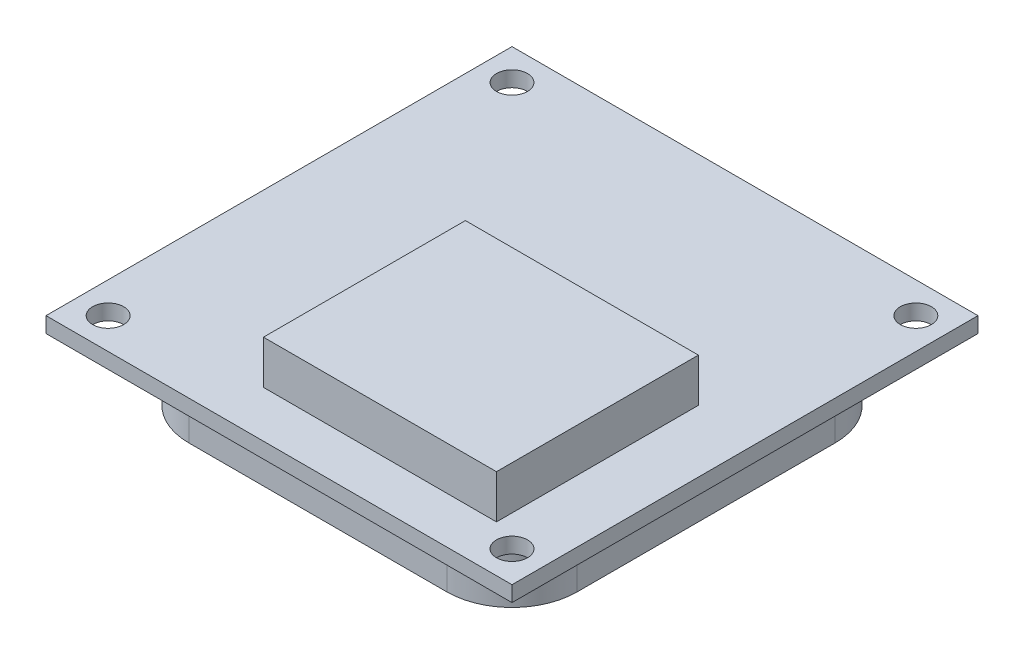
ISO-10303-21;
HEADER;
FILE_DESCRIPTION(('STEP AP214'),'2;1');
FILE_NAME('part.step','',(''),(''),'','','');
FILE_SCHEMA(('AUTOMOTIVE_DESIGN { 1 0 10303 214 1 1 1 1 }'));
ENDSEC;
DATA;
#1=APPLICATION_CONTEXT('core data for automotive mechanical design processes');
#2=APPLICATION_PROTOCOL_DEFINITION('international standard','automotive_design',2000,#1);
#3=PRODUCT_CONTEXT('',#1,'mechanical');
#4=PRODUCT('Part','Part','',(#3));
#5=PRODUCT_RELATED_PRODUCT_CATEGORY('part','',(#4));
#6=PRODUCT_DEFINITION_FORMATION('','',#4);
#7=PRODUCT_DEFINITION_CONTEXT('part definition',#1,'design');
#8=PRODUCT_DEFINITION('design','',#6,#7);
#9=PRODUCT_DEFINITION_SHAPE('','',#8);
#10=(LENGTH_UNIT() NAMED_UNIT(*) SI_UNIT(.MILLI.,.METRE.));
#11=(NAMED_UNIT(*) PLANE_ANGLE_UNIT() SI_UNIT($,.RADIAN.));
#12=(NAMED_UNIT(*) SI_UNIT($,.STERADIAN.) SOLID_ANGLE_UNIT());
#13=UNCERTAINTY_MEASURE_WITH_UNIT(LENGTH_MEASURE(1.E-05),#10,'distance_accuracy_value','');
#14=(GEOMETRIC_REPRESENTATION_CONTEXT(3) GLOBAL_UNCERTAINTY_ASSIGNED_CONTEXT((#13)) GLOBAL_UNIT_ASSIGNED_CONTEXT((#10,
#11,#12)) REPRESENTATION_CONTEXT('',''));
#15=CARTESIAN_POINT('',(0.,0.,0.));
#16=DIRECTION('',(0.,0.,1.));
#17=DIRECTION('',(1.,0.,0.));
#18=AXIS2_PLACEMENT_3D('',#15,#16,#17);
#19=CARTESIAN_POINT('',(0.,0.,0.));
#20=DIRECTION('',(0.,1.,0.));
#21=DIRECTION('',(0.,0.,1.));
#22=AXIS2_PLACEMENT_3D('',#19,#20,#21);
#23=PLANE('',#22);
#24=CARTESIAN_POINT('',(-10.6176470588235,0.,18.4264705882353));
#25=DIRECTION('',(0.,1.,0.));
#26=DIRECTION('',(0.,0.,1.));
#27=AXIS2_PLACEMENT_3D('',#24,#25,#26);
#28=CIRCLE('',#27,1.);
#29=CARTESIAN_POINT('',(-10.6176470588235,0.,19.4264705882353));
#30=VERTEX_POINT('',#29);
#31=EDGE_CURVE('E201',#30,#30,#28,.T.);
#32=ORIENTED_EDGE('',*,*,#31,.T.);
#33=EDGE_LOOP('',(#32));
#34=FACE_BOUND('',#33,.T.);
#35=CARTESIAN_POINT('',(15.3823529411765,0.,18.4264705882353));
#36=DIRECTION('',(0.,1.,0.));
#37=DIRECTION('',(0.,0.,1.));
#38=AXIS2_PLACEMENT_3D('',#35,#36,#37);
#39=CIRCLE('',#38,1.);
#40=CARTESIAN_POINT('',(15.3823529411765,0.,19.4264705882353));
#41=VERTEX_POINT('',#40);
#42=EDGE_CURVE('E205',#41,#41,#39,.T.);
#43=ORIENTED_EDGE('',*,*,#42,.T.);
#44=EDGE_LOOP('',(#43));
#45=FACE_BOUND('',#44,.T.);
#46=CARTESIAN_POINT('',(15.3823529411765,0.,-7.57352941176471));
#47=DIRECTION('',(0.,1.,0.));
#48=DIRECTION('',(0.,0.,1.));
#49=AXIS2_PLACEMENT_3D('',#46,#47,#48);
#50=CIRCLE('',#49,1.);
#51=CARTESIAN_POINT('',(15.3823529411765,0.,-6.5735294117647));
#52=VERTEX_POINT('',#51);
#53=EDGE_CURVE('E211',#52,#52,#50,.T.);
#54=ORIENTED_EDGE('',*,*,#53,.T.);
#55=EDGE_LOOP('',(#54));
#56=FACE_BOUND('',#55,.T.);
#57=CARTESIAN_POINT('',(-10.6176470588235,0.,-7.57352941176471));
#58=DIRECTION('',(0.,1.,0.));
#59=DIRECTION('',(0.,0.,1.));
#60=AXIS2_PLACEMENT_3D('',#57,#58,#59);
#61=CIRCLE('',#60,1.);
#62=CARTESIAN_POINT('',(-10.6176470588235,0.,-6.5735294117647));
#63=VERTEX_POINT('',#62);
#64=EDGE_CURVE('E217',#63,#63,#61,.T.);
#65=ORIENTED_EDGE('',*,*,#64,.T.);
#66=EDGE_LOOP('',(#65));
#67=FACE_BOUND('',#66,.T.);
#68=DIRECTION('',(0.,0.,1.));
#69=VECTOR('',#68,1.);
#70=CARTESIAN_POINT('',(-12.6176470588235,0.,-9.57352941176471));
#71=LINE('',#70,#69);
#72=CARTESIAN_POINT('',(-12.6176470588235,0.,-9.57352941176471));
#73=VERTEX_POINT('',#72);
#74=CARTESIAN_POINT('',(-12.6176470588235,0.,20.4264705882353));
#75=VERTEX_POINT('',#74);
#76=EDGE_CURVE('E223',#73,#75,#71,.T.);
#77=ORIENTED_EDGE('',*,*,#76,.F.);
#78=DIRECTION('',(-1.,0.,0.));
#79=VECTOR('',#78,1.);
#80=CARTESIAN_POINT('',(-12.6176470588235,0.,-9.57352941176471));
#81=LINE('',#80,#79);
#82=CARTESIAN_POINT('',(17.3823529411765,0.,-9.57352941176471));
#83=VERTEX_POINT('',#82);
#84=EDGE_CURVE('E230',#83,#73,#81,.T.);
#85=ORIENTED_EDGE('',*,*,#84,.F.);
#86=DIRECTION('',(0.,0.,-1.));
#87=VECTOR('',#86,1.);
#88=CARTESIAN_POINT('',(17.3823529411765,0.,-9.57352941176471));
#89=LINE('',#88,#87);
#90=CARTESIAN_POINT('',(17.3823529411765,0.,20.4264705882353));
#91=VERTEX_POINT('',#90);
#92=EDGE_CURVE('E241',#91,#83,#89,.T.);
#93=ORIENTED_EDGE('',*,*,#92,.F.);
#94=DIRECTION('',(1.,0.,0.));
#95=VECTOR('',#94,1.);
#96=CARTESIAN_POINT('',(-12.6176470588235,0.,20.4264705882353));
#97=LINE('',#96,#95);
#98=EDGE_CURVE('E239',#75,#91,#97,.T.);
#99=ORIENTED_EDGE('',*,*,#98,.F.);
#100=EDGE_LOOP('',(#77,#85,#93,#99));
#101=FACE_BOUND('',#100,.T.);
#102=CARTESIAN_POINT('',(10.6908576201184,0.,13.7349752671772));
#103=DIRECTION('',(0.,-1.,0.));
#104=DIRECTION('',(0.,0.,1.));
#105=AXIS2_PLACEMENT_3D('',#102,#103,#104);
#106=CIRCLE('',#105,4.19149532105807);
#107=CARTESIAN_POINT('',(14.8823529411765,0.,13.7349752671772));
#108=VERTEX_POINT('',#107);
#109=CARTESIAN_POINT('',(10.6908576201184,0.,17.9264705882353));
#110=VERTEX_POINT('',#109);
#111=EDGE_CURVE('E166',#108,#110,#106,.T.);
#112=ORIENTED_EDGE('',*,*,#111,.F.);
#113=DIRECTION('',(0.,0.,1.));
#114=VECTOR('',#113,1.);
#115=CARTESIAN_POINT('',(14.8823529411765,0.,13.7349752671772));
#116=LINE('',#115,#114);
#117=CARTESIAN_POINT('',(14.8823529411765,0.,-2.88203409070664));
#118=VERTEX_POINT('',#117);
#119=EDGE_CURVE('E163',#118,#108,#116,.T.);
#120=ORIENTED_EDGE('',*,*,#119,.F.);
#121=CARTESIAN_POINT('',(10.6908576201184,0.,-2.88203409070664));
#122=DIRECTION('',(0.,-1.,0.));
#123=DIRECTION('',(0.,0.,1.));
#124=AXIS2_PLACEMENT_3D('',#121,#122,#123);
#125=CIRCLE('',#124,4.19149532105807);
#126=CARTESIAN_POINT('',(10.6908576201184,0.,-7.07352941176471));
#127=VERTEX_POINT('',#126);
#128=EDGE_CURVE('E500',#127,#118,#125,.T.);
#129=ORIENTED_EDGE('',*,*,#128,.F.);
#130=DIRECTION('',(1.,0.,0.));
#131=VECTOR('',#130,1.);
#132=CARTESIAN_POINT('',(-5.92615173776546,0.,-7.07352941176471));
#133=LINE('',#132,#131);
#134=CARTESIAN_POINT('',(-5.92615173776546,0.,-7.07352941176471));
#135=VERTEX_POINT('',#134);
#136=EDGE_CURVE('E531',#135,#127,#133,.T.);
#137=ORIENTED_EDGE('',*,*,#136,.F.);
#138=CARTESIAN_POINT('',(-5.92615173776546,0.,-2.88203409070664));
#139=DIRECTION('',(0.,-1.,0.));
#140=DIRECTION('',(0.,0.,1.));
#141=AXIS2_PLACEMENT_3D('',#138,#139,#140);
#142=CIRCLE('',#141,4.19149532105807);
#143=CARTESIAN_POINT('',(-10.1176470588235,0.,-2.88203409070664));
#144=VERTEX_POINT('',#143);
#145=EDGE_CURVE('E524',#144,#135,#142,.T.);
#146=ORIENTED_EDGE('',*,*,#145,.F.);
#147=DIRECTION('',(0.,0.,-1.));
#148=VECTOR('',#147,1.);
#149=CARTESIAN_POINT('',(-10.1176470588235,0.,13.7349752671772));
#150=LINE('',#149,#148);
#151=CARTESIAN_POINT('',(-10.1176470588235,0.,13.7349752671772));
#152=VERTEX_POINT('',#151);
#153=EDGE_CURVE('E521',#152,#144,#150,.T.);
#154=ORIENTED_EDGE('',*,*,#153,.F.);
#155=CARTESIAN_POINT('',(-5.92615173776546,0.,13.7349752671772));
#156=DIRECTION('',(0.,-1.,0.));
#157=DIRECTION('',(0.,0.,1.));
#158=AXIS2_PLACEMENT_3D('',#155,#156,#157);
#159=CIRCLE('',#158,4.19149532105807);
#160=CARTESIAN_POINT('',(-5.92615173776546,0.,17.9264705882353));
#161=VERTEX_POINT('',#160);
#162=EDGE_CURVE('E53',#161,#152,#159,.T.);
#163=ORIENTED_EDGE('',*,*,#162,.F.);
#164=DIRECTION('',(-1.,0.,0.));
#165=VECTOR('',#164,1.);
#166=CARTESIAN_POINT('',(-5.92615173776546,0.,17.9264705882353));
#167=LINE('',#166,#165);
#168=EDGE_CURVE('E48',#110,#161,#167,.T.);
#169=ORIENTED_EDGE('',*,*,#168,.F.);
#170=EDGE_LOOP('',(#112,#120,#129,#137,#146,#154,#163,#169));
#171=FACE_BOUND('',#170,.T.);
#172=ADVANCED_FACE('F33',(#34,#45,#56,#67,#101,#171),#23,.F.);
#173=CARTESIAN_POINT('',(0.,1.,0.));
#174=DIRECTION('',(0.,1.,0.));
#175=DIRECTION('',(0.,0.,1.));
#176=AXIS2_PLACEMENT_3D('',#173,#174,#175);
#177=PLANE('',#176);
#178=CARTESIAN_POINT('',(15.3823529411765,1.,18.4264705882353));
#179=DIRECTION('',(0.,1.,0.));
#180=DIRECTION('',(0.,0.,1.));
#181=AXIS2_PLACEMENT_3D('',#178,#179,#180);
#182=CIRCLE('',#181,1.);
#183=CARTESIAN_POINT('',(15.3823529411765,1.,19.4264705882353));
#184=VERTEX_POINT('',#183);
#185=EDGE_CURVE('E208',#184,#184,#182,.T.);
#186=ORIENTED_EDGE('',*,*,#185,.F.);
#187=EDGE_LOOP('',(#186));
#188=FACE_BOUND('',#187,.T.);
#189=CARTESIAN_POINT('',(-10.6176470588235,1.,-7.57352941176471));
#190=DIRECTION('',(0.,1.,0.));
#191=DIRECTION('',(0.,0.,1.));
#192=AXIS2_PLACEMENT_3D('',#189,#190,#191);
#193=CIRCLE('',#192,1.);
#194=CARTESIAN_POINT('',(-10.6176470588235,1.,-6.5735294117647));
#195=VERTEX_POINT('',#194);
#196=EDGE_CURVE('E220',#195,#195,#193,.T.);
#197=ORIENTED_EDGE('',*,*,#196,.F.);
#198=EDGE_LOOP('',(#197));
#199=FACE_BOUND('',#198,.T.);
#200=DIRECTION('',(0.,0.,1.));
#201=VECTOR('',#200,1.);
#202=CARTESIAN_POINT('',(-12.6176470588235,1.,-9.57352941176471));
#203=LINE('',#202,#201);
#204=CARTESIAN_POINT('',(-12.6176470588235,1.,-9.57352941176471));
#205=VERTEX_POINT('',#204);
#206=CARTESIAN_POINT('',(-12.6176470588235,1.,20.4264705882353));
#207=VERTEX_POINT('',#206);
#208=EDGE_CURVE('E226',#205,#207,#203,.T.);
#209=ORIENTED_EDGE('',*,*,#208,.T.);
#210=DIRECTION('',(1.,0.,0.));
#211=VECTOR('',#210,1.);
#212=CARTESIAN_POINT('',(-12.6176470588235,1.,20.4264705882353));
#213=LINE('',#212,#211);
#214=CARTESIAN_POINT('',(17.3823529411765,1.,20.4264705882353));
#215=VERTEX_POINT('',#214);
#216=EDGE_CURVE('E229',#207,#215,#213,.T.);
#217=ORIENTED_EDGE('',*,*,#216,.T.);
#218=DIRECTION('',(0.,0.,-1.));
#219=VECTOR('',#218,1.);
#220=CARTESIAN_POINT('',(17.3823529411765,1.,-9.57352941176471));
#221=LINE('',#220,#219);
#222=CARTESIAN_POINT('',(17.3823529411765,1.,-9.57352941176471));
#223=VERTEX_POINT('',#222);
#224=EDGE_CURVE('E232',#215,#223,#221,.T.);
#225=ORIENTED_EDGE('',*,*,#224,.T.);
#226=DIRECTION('',(-1.,0.,0.));
#227=VECTOR('',#226,1.);
#228=CARTESIAN_POINT('',(-12.6176470588235,1.,-9.57352941176471));
#229=LINE('',#228,#227);
#230=EDGE_CURVE('E234',#223,#205,#229,.T.);
#231=ORIENTED_EDGE('',*,*,#230,.T.);
#232=EDGE_LOOP('',(#209,#217,#225,#231));
#233=FACE_BOUND('',#232,.T.);
#234=CARTESIAN_POINT('',(15.3823529411765,1.,-7.57352941176471));
#235=DIRECTION('',(0.,1.,0.));
#236=DIRECTION('',(0.,0.,1.));
#237=AXIS2_PLACEMENT_3D('',#234,#235,#236);
#238=CIRCLE('',#237,1.);
#239=CARTESIAN_POINT('',(15.3823529411765,1.,-6.5735294117647));
#240=VERTEX_POINT('',#239);
#241=EDGE_CURVE('E214',#240,#240,#238,.T.);
#242=ORIENTED_EDGE('',*,*,#241,.F.);
#243=EDGE_LOOP('',(#242));
#244=FACE_BOUND('',#243,.T.);
#245=CARTESIAN_POINT('',(-10.6176470588235,1.,18.4264705882353));
#246=DIRECTION('',(0.,1.,0.));
#247=DIRECTION('',(0.,0.,1.));
#248=AXIS2_PLACEMENT_3D('',#245,#246,#247);
#249=CIRCLE('',#248,1.);
#250=CARTESIAN_POINT('',(-10.6176470588235,1.,19.4264705882353));
#251=VERTEX_POINT('',#250);
#252=EDGE_CURVE('E202',#251,#251,#249,.T.);
#253=ORIENTED_EDGE('',*,*,#252,.F.);
#254=EDGE_LOOP('',(#253));
#255=FACE_BOUND('',#254,.T.);
#256=DIRECTION('',(1.,0.,0.));
#257=VECTOR('',#256,1.);
#258=CARTESIAN_POINT('',(-1.61764705882352,1.,17.4264705882353));
#259=LINE('',#258,#257);
#260=CARTESIAN_POINT('',(-1.61764705882352,1.,17.4264705882353));
#261=VERTEX_POINT('',#260);
#262=CARTESIAN_POINT('',(13.3823529411765,1.,17.4264705882353));
#263=VERTEX_POINT('',#262);
#264=EDGE_CURVE('E170',#261,#263,#259,.T.);
#265=ORIENTED_EDGE('',*,*,#264,.F.);
#266=DIRECTION('',(0.,0.,1.));
#267=VECTOR('',#266,1.);
#268=CARTESIAN_POINT('',(-1.61764705882353,1.,4.42647058823529));
#269=LINE('',#268,#267);
#270=CARTESIAN_POINT('',(-1.61764705882353,1.,4.42647058823529));
#271=VERTEX_POINT('',#270);
#272=EDGE_CURVE('E167',#271,#261,#269,.T.);
#273=ORIENTED_EDGE('',*,*,#272,.F.);
#274=DIRECTION('',(-1.,0.,0.));
#275=VECTOR('',#274,1.);
#276=CARTESIAN_POINT('',(-1.61764705882353,1.,4.42647058823529));
#277=LINE('',#276,#275);
#278=CARTESIAN_POINT('',(13.3823529411765,1.,4.42647058823529));
#279=VERTEX_POINT('',#278);
#280=EDGE_CURVE('E180',#279,#271,#277,.T.);
#281=ORIENTED_EDGE('',*,*,#280,.F.);
#282=DIRECTION('',(0.,0.,-1.));
#283=VECTOR('',#282,1.);
#284=CARTESIAN_POINT('',(13.3823529411765,1.,4.42647058823529));
#285=LINE('',#284,#283);
#286=EDGE_CURVE('E188',#263,#279,#285,.T.);
#287=ORIENTED_EDGE('',*,*,#286,.F.);
#288=EDGE_LOOP('',(#265,#273,#281,#287));
#289=FACE_BOUND('',#288,.T.);
#290=ADVANCED_FACE('F267',(#188,#199,#233,#244,#255,#289),#177,.T.);
#291=CARTESIAN_POINT('',(-12.6176470588235,1.,-9.57352941176471));
#292=DIRECTION('',(1.,0.,0.));
#293=DIRECTION('',(0.,0.,-1.));
#294=AXIS2_PLACEMENT_3D('',#291,#292,#293);
#295=PLANE('',#294);
#296=ORIENTED_EDGE('',*,*,#76,.T.);
#297=DIRECTION('',(0.,-1.,0.));
#298=VECTOR('',#297,1.);
#299=CARTESIAN_POINT('',(-12.6176470588235,1.,20.4264705882353));
#300=LINE('',#299,#298);
#301=EDGE_CURVE('E11',#207,#75,#300,.T.);
#302=ORIENTED_EDGE('',*,*,#301,.F.);
#303=ORIENTED_EDGE('',*,*,#208,.F.);
#304=DIRECTION('',(0.,-1.,0.));
#305=VECTOR('',#304,1.);
#306=CARTESIAN_POINT('',(-12.6176470588235,1.,-9.57352941176471));
#307=LINE('',#306,#305);
#308=EDGE_CURVE('E236',#205,#73,#307,.T.);
#309=ORIENTED_EDGE('',*,*,#308,.T.);
#310=EDGE_LOOP('',(#296,#302,#303,#309));
#311=FACE_BOUND('',#310,.T.);
#312=ADVANCED_FACE('F35',(#311),#295,.F.);
#313=CARTESIAN_POINT('',(-12.6176470588235,1.,20.4264705882353));
#314=DIRECTION('',(0.,0.,-1.));
#315=DIRECTION('',(-1.,0.,0.));
#316=AXIS2_PLACEMENT_3D('',#313,#314,#315);
#317=PLANE('',#316);
#318=ORIENTED_EDGE('',*,*,#98,.T.);
#319=DIRECTION('',(0.,-1.,0.));
#320=VECTOR('',#319,1.);
#321=CARTESIAN_POINT('',(17.3823529411765,1.,20.4264705882353));
#322=LINE('',#321,#320);
#323=EDGE_CURVE('E41',#215,#91,#322,.T.);
#324=ORIENTED_EDGE('',*,*,#323,.F.);
#325=ORIENTED_EDGE('',*,*,#216,.F.);
#326=ORIENTED_EDGE('',*,*,#301,.T.);
#327=EDGE_LOOP('',(#318,#324,#325,#326));
#328=FACE_BOUND('',#327,.T.);
#329=ADVANCED_FACE('F269',(#328),#317,.F.);
#330=CARTESIAN_POINT('',(17.3823529411765,1.,-9.57352941176471));
#331=DIRECTION('',(-1.,0.,0.));
#332=DIRECTION('',(0.,0.,1.));
#333=AXIS2_PLACEMENT_3D('',#330,#331,#332);
#334=PLANE('',#333);
#335=ORIENTED_EDGE('',*,*,#92,.T.);
#336=DIRECTION('',(0.,-1.,0.));
#337=VECTOR('',#336,1.);
#338=CARTESIAN_POINT('',(17.3823529411765,1.,-9.57352941176471));
#339=LINE('',#338,#337);
#340=EDGE_CURVE('E246',#223,#83,#339,.T.);
#341=ORIENTED_EDGE('',*,*,#340,.F.);
#342=ORIENTED_EDGE('',*,*,#224,.F.);
#343=ORIENTED_EDGE('',*,*,#323,.T.);
#344=EDGE_LOOP('',(#335,#341,#342,#343));
#345=FACE_BOUND('',#344,.T.);
#346=ADVANCED_FACE('F253',(#345),#334,.F.);
#347=CARTESIAN_POINT('',(-12.6176470588235,1.,-9.57352941176471));
#348=DIRECTION('',(0.,0.,1.));
#349=DIRECTION('',(1.,0.,0.));
#350=AXIS2_PLACEMENT_3D('',#347,#348,#349);
#351=PLANE('',#350);
#352=ORIENTED_EDGE('',*,*,#84,.T.);
#353=ORIENTED_EDGE('',*,*,#308,.F.);
#354=ORIENTED_EDGE('',*,*,#230,.F.);
#355=ORIENTED_EDGE('',*,*,#340,.T.);
#356=EDGE_LOOP('',(#352,#353,#354,#355));
#357=FACE_BOUND('',#356,.T.);
#358=ADVANCED_FACE('F261',(#357),#351,.F.);
#359=CARTESIAN_POINT('',(-10.6176470588235,1.,-7.57352941176471));
#360=DIRECTION('',(0.,-1.,0.));
#361=DIRECTION('',(0.,0.,-1.));
#362=AXIS2_PLACEMENT_3D('',#359,#360,#361);
#363=CYLINDRICAL_SURFACE('',#362,1.);
#364=ORIENTED_EDGE('',*,*,#196,.T.);
#365=EDGE_LOOP('',(#364));
#366=FACE_BOUND('',#365,.T.);
#367=ORIENTED_EDGE('',*,*,#64,.F.);
#368=EDGE_LOOP('',(#367));
#369=FACE_BOUND('',#368,.T.);
#370=ADVANCED_FACE('F288',(#366,#369),#363,.F.);
#371=CARTESIAN_POINT('',(15.3823529411765,1.,-7.57352941176471));
#372=DIRECTION('',(0.,-1.,0.));
#373=DIRECTION('',(0.,0.,-1.));
#374=AXIS2_PLACEMENT_3D('',#371,#372,#373);
#375=CYLINDRICAL_SURFACE('',#374,1.);
#376=ORIENTED_EDGE('',*,*,#241,.T.);
#377=EDGE_LOOP('',(#376));
#378=FACE_BOUND('',#377,.T.);
#379=ORIENTED_EDGE('',*,*,#53,.F.);
#380=EDGE_LOOP('',(#379));
#381=FACE_BOUND('',#380,.T.);
#382=ADVANCED_FACE('F292',(#378,#381),#375,.F.);
#383=CARTESIAN_POINT('',(15.3823529411765,1.,18.4264705882353));
#384=DIRECTION('',(0.,-1.,0.));
#385=DIRECTION('',(0.,0.,-1.));
#386=AXIS2_PLACEMENT_3D('',#383,#384,#385);
#387=CYLINDRICAL_SURFACE('',#386,1.);
#388=ORIENTED_EDGE('',*,*,#185,.T.);
#389=EDGE_LOOP('',(#388));
#390=FACE_BOUND('',#389,.T.);
#391=ORIENTED_EDGE('',*,*,#42,.F.);
#392=EDGE_LOOP('',(#391));
#393=FACE_BOUND('',#392,.T.);
#394=ADVANCED_FACE('F297',(#390,#393),#387,.F.);
#395=CARTESIAN_POINT('',(-10.6176470588235,1.,18.4264705882353));
#396=DIRECTION('',(0.,-1.,0.));
#397=DIRECTION('',(0.,0.,-1.));
#398=AXIS2_PLACEMENT_3D('',#395,#396,#397);
#399=CYLINDRICAL_SURFACE('',#398,1.);
#400=ORIENTED_EDGE('',*,*,#252,.T.);
#401=EDGE_LOOP('',(#400));
#402=FACE_BOUND('',#401,.T.);
#403=ORIENTED_EDGE('',*,*,#31,.F.);
#404=EDGE_LOOP('',(#403));
#405=FACE_BOUND('',#404,.T.);
#406=ADVANCED_FACE('F304',(#402,#405),#399,.F.);
#407=CARTESIAN_POINT('',(-1.61764705882353,3.8,4.42647058823529));
#408=DIRECTION('',(1.,0.,0.));
#409=DIRECTION('',(0.,0.,-1.));
#410=AXIS2_PLACEMENT_3D('',#407,#408,#409);
#411=PLANE('',#410);
#412=ORIENTED_EDGE('',*,*,#272,.T.);
#413=DIRECTION('',(0.,-1.,0.));
#414=VECTOR('',#413,1.);
#415=CARTESIAN_POINT('',(-1.61764705882352,3.8,17.4264705882353));
#416=LINE('',#415,#414);
#417=CARTESIAN_POINT('',(-1.61764705882352,3.8,17.4264705882353));
#418=VERTEX_POINT('',#417);
#419=EDGE_CURVE('E199',#418,#261,#416,.T.);
#420=ORIENTED_EDGE('',*,*,#419,.F.);
#421=DIRECTION('',(0.,0.,1.));
#422=VECTOR('',#421,1.);
#423=CARTESIAN_POINT('',(-1.61764705882353,3.8,4.42647058823529));
#424=LINE('',#423,#422);
#425=CARTESIAN_POINT('',(-1.61764705882353,3.8,4.42647058823529));
#426=VERTEX_POINT('',#425);
#427=EDGE_CURVE('E176',#426,#418,#424,.T.);
#428=ORIENTED_EDGE('',*,*,#427,.F.);
#429=DIRECTION('',(0.,-1.,0.));
#430=VECTOR('',#429,1.);
#431=CARTESIAN_POINT('',(-1.61764705882353,3.8,4.42647058823529));
#432=LINE('',#431,#430);
#433=EDGE_CURVE('E185',#426,#271,#432,.T.);
#434=ORIENTED_EDGE('',*,*,#433,.T.);
#435=EDGE_LOOP('',(#412,#420,#428,#434));
#436=FACE_BOUND('',#435,.T.);
#437=ADVANCED_FACE('F308',(#436),#411,.F.);
#438=CARTESIAN_POINT('',(-1.61764705882352,3.8,17.4264705882353));
#439=DIRECTION('',(0.,0.,-1.));
#440=DIRECTION('',(-1.,0.,0.));
#441=AXIS2_PLACEMENT_3D('',#438,#439,#440);
#442=PLANE('',#441);
#443=ORIENTED_EDGE('',*,*,#264,.T.);
#444=DIRECTION('',(0.,-1.,0.));
#445=VECTOR('',#444,1.);
#446=CARTESIAN_POINT('',(13.3823529411765,3.8,17.4264705882353));
#447=LINE('',#446,#445);
#448=CARTESIAN_POINT('',(13.3823529411765,3.8,17.4264705882353));
#449=VERTEX_POINT('',#448);
#450=EDGE_CURVE('E196',#449,#263,#447,.T.);
#451=ORIENTED_EDGE('',*,*,#450,.F.);
#452=DIRECTION('',(1.,0.,0.));
#453=VECTOR('',#452,1.);
#454=CARTESIAN_POINT('',(-1.61764705882352,3.8,17.4264705882353));
#455=LINE('',#454,#453);
#456=EDGE_CURVE('E179',#418,#449,#455,.T.);
#457=ORIENTED_EDGE('',*,*,#456,.F.);
#458=ORIENTED_EDGE('',*,*,#419,.T.);
#459=EDGE_LOOP('',(#443,#451,#457,#458));
#460=FACE_BOUND('',#459,.T.);
#461=ADVANCED_FACE('F312',(#460),#442,.F.);
#462=CARTESIAN_POINT('',(13.3823529411765,3.8,4.42647058823529));
#463=DIRECTION('',(-1.,0.,0.));
#464=DIRECTION('',(0.,0.,1.));
#465=AXIS2_PLACEMENT_3D('',#462,#463,#464);
#466=PLANE('',#465);
#467=ORIENTED_EDGE('',*,*,#286,.T.);
#468=DIRECTION('',(0.,-1.,0.));
#469=VECTOR('',#468,1.);
#470=CARTESIAN_POINT('',(13.3823529411765,3.8,4.42647058823529));
#471=LINE('',#470,#469);
#472=CARTESIAN_POINT('',(13.3823529411765,3.8,4.42647058823529));
#473=VERTEX_POINT('',#472);
#474=EDGE_CURVE('E194',#473,#279,#471,.T.);
#475=ORIENTED_EDGE('',*,*,#474,.F.);
#476=DIRECTION('',(0.,0.,-1.));
#477=VECTOR('',#476,1.);
#478=CARTESIAN_POINT('',(13.3823529411765,3.8,4.42647058823529));
#479=LINE('',#478,#477);
#480=EDGE_CURVE('E182',#449,#473,#479,.T.);
#481=ORIENTED_EDGE('',*,*,#480,.F.);
#482=ORIENTED_EDGE('',*,*,#450,.T.);
#483=EDGE_LOOP('',(#467,#475,#481,#482));
#484=FACE_BOUND('',#483,.T.);
#485=ADVANCED_FACE('F316',(#484),#466,.F.);
#486=CARTESIAN_POINT('',(-1.61764705882353,3.8,4.42647058823529));
#487=DIRECTION('',(0.,0.,1.));
#488=DIRECTION('',(1.,0.,0.));
#489=AXIS2_PLACEMENT_3D('',#486,#487,#488);
#490=PLANE('',#489);
#491=ORIENTED_EDGE('',*,*,#280,.T.);
#492=ORIENTED_EDGE('',*,*,#433,.F.);
#493=DIRECTION('',(-1.,0.,0.));
#494=VECTOR('',#493,1.);
#495=CARTESIAN_POINT('',(-1.61764705882353,3.8,4.42647058823529));
#496=LINE('',#495,#494);
#497=EDGE_CURVE('E184',#473,#426,#496,.T.);
#498=ORIENTED_EDGE('',*,*,#497,.F.);
#499=ORIENTED_EDGE('',*,*,#474,.T.);
#500=EDGE_LOOP('',(#491,#492,#498,#499));
#501=FACE_BOUND('',#500,.T.);
#502=ADVANCED_FACE('F320',(#501),#490,.F.);
#503=CARTESIAN_POINT('',(0.,3.8,0.));
#504=DIRECTION('',(0.,1.,0.));
#505=DIRECTION('',(0.,0.,1.));
#506=AXIS2_PLACEMENT_3D('',#503,#504,#505);
#507=PLANE('',#506);
#508=ORIENTED_EDGE('',*,*,#427,.T.);
#509=ORIENTED_EDGE('',*,*,#456,.T.);
#510=ORIENTED_EDGE('',*,*,#480,.T.);
#511=ORIENTED_EDGE('',*,*,#497,.T.);
#512=EDGE_LOOP('',(#508,#509,#510,#511));
#513=FACE_BOUND('',#512,.T.);
#514=ADVANCED_FACE('F324',(#513),#507,.T.);
#515=CARTESIAN_POINT('',(10.6908576201184,-4.,13.7349752671772));
#516=DIRECTION('',(0.,1.,0.));
#517=DIRECTION('',(0.,0.,1.));
#518=AXIS2_PLACEMENT_3D('',#515,#516,#517);
#519=CYLINDRICAL_SURFACE('',#518,4.19149532105807);
#520=ORIENTED_EDGE('',*,*,#111,.T.);
#521=DIRECTION('',(0.,1.,0.));
#522=VECTOR('',#521,1.);
#523=CARTESIAN_POINT('',(10.6908576201184,-4.,17.9264705882353));
#524=LINE('',#523,#522);
#525=CARTESIAN_POINT('',(10.6908576201184,-4.,17.9264705882353));
#526=VERTEX_POINT('',#525);
#527=EDGE_CURVE('E147',#526,#110,#524,.T.);
#528=ORIENTED_EDGE('',*,*,#527,.F.);
#529=CARTESIAN_POINT('',(10.6908576201184,-4.,13.7349752671772));
#530=DIRECTION('',(0.,-1.,0.));
#531=DIRECTION('',(0.,0.,1.));
#532=AXIS2_PLACEMENT_3D('',#529,#530,#531);
#533=CIRCLE('',#532,4.19149532105807);
#534=CARTESIAN_POINT('',(14.8823529411765,-4.,13.7349752671772));
#535=VERTEX_POINT('',#534);
#536=EDGE_CURVE('E154',#535,#526,#533,.T.);
#537=ORIENTED_EDGE('',*,*,#536,.F.);
#538=DIRECTION('',(0.,1.,0.));
#539=VECTOR('',#538,1.);
#540=CARTESIAN_POINT('',(14.8823529411765,-4.,13.7349752671772));
#541=LINE('',#540,#539);
#542=EDGE_CURVE('E496',#535,#108,#541,.T.);
#543=ORIENTED_EDGE('',*,*,#542,.T.);
#544=EDGE_LOOP('',(#520,#528,#537,#543));
#545=FACE_BOUND('',#544,.T.);
#546=ADVANCED_FACE('F165',(#545),#519,.T.);
#547=CARTESIAN_POINT('',(-5.92615173776546,-4.,17.9264705882353));
#548=DIRECTION('',(0.,0.,-1.));
#549=DIRECTION('',(-1.,0.,0.));
#550=AXIS2_PLACEMENT_3D('',#547,#548,#549);
#551=PLANE('',#550);
#552=ORIENTED_EDGE('',*,*,#168,.T.);
#553=DIRECTION('',(0.,1.,0.));
#554=VECTOR('',#553,1.);
#555=CARTESIAN_POINT('',(-5.92615173776546,-4.,17.9264705882353));
#556=LINE('',#555,#554);
#557=CARTESIAN_POINT('',(-5.92615173776546,-4.,17.9264705882353));
#558=VERTEX_POINT('',#557);
#559=EDGE_CURVE('E150',#558,#161,#556,.T.);
#560=ORIENTED_EDGE('',*,*,#559,.F.);
#561=DIRECTION('',(-1.,0.,0.));
#562=VECTOR('',#561,1.);
#563=CARTESIAN_POINT('',(-5.92615173776546,-4.,17.9264705882353));
#564=LINE('',#563,#562);
#565=EDGE_CURVE('E143',#526,#558,#564,.T.);
#566=ORIENTED_EDGE('',*,*,#565,.F.);
#567=ORIENTED_EDGE('',*,*,#527,.T.);
#568=EDGE_LOOP('',(#552,#560,#566,#567));
#569=FACE_BOUND('',#568,.T.);
#570=ADVANCED_FACE('F145',(#569),#551,.F.);
#571=CARTESIAN_POINT('',(-5.92615173776546,-4.,13.7349752671772));
#572=DIRECTION('',(0.,1.,0.));
#573=DIRECTION('',(0.,0.,1.));
#574=AXIS2_PLACEMENT_3D('',#571,#572,#573);
#575=CYLINDRICAL_SURFACE('',#574,4.19149532105807);
#576=ORIENTED_EDGE('',*,*,#162,.T.);
#577=DIRECTION('',(0.,1.,0.));
#578=VECTOR('',#577,1.);
#579=CARTESIAN_POINT('',(-10.1176470588235,-4.,13.7349752671772));
#580=LINE('',#579,#578);
#581=CARTESIAN_POINT('',(-10.1176470588235,-4.,13.7349752671772));
#582=VERTEX_POINT('',#581);
#583=EDGE_CURVE('E172',#582,#152,#580,.T.);
#584=ORIENTED_EDGE('',*,*,#583,.F.);
#585=CARTESIAN_POINT('',(-5.92615173776546,-4.,13.7349752671772));
#586=DIRECTION('',(0.,-1.,0.));
#587=DIRECTION('',(0.,0.,1.));
#588=AXIS2_PLACEMENT_3D('',#585,#586,#587);
#589=CIRCLE('',#588,4.19149532105807);
#590=EDGE_CURVE('E153',#558,#582,#589,.T.);
#591=ORIENTED_EDGE('',*,*,#590,.F.);
#592=ORIENTED_EDGE('',*,*,#559,.T.);
#593=EDGE_LOOP('',(#576,#584,#591,#592));
#594=FACE_BOUND('',#593,.T.);
#595=ADVANCED_FACE('F333',(#594),#575,.T.);
#596=CARTESIAN_POINT('',(-10.1176470588235,-4.,13.7349752671772));
#597=DIRECTION('',(1.,0.,0.));
#598=DIRECTION('',(0.,0.,-1.));
#599=AXIS2_PLACEMENT_3D('',#596,#597,#598);
#600=PLANE('',#599);
#601=ORIENTED_EDGE('',*,*,#153,.T.);
#602=DIRECTION('',(0.,1.,0.));
#603=VECTOR('',#602,1.);
#604=CARTESIAN_POINT('',(-10.1176470588235,-4.,-2.88203409070664));
#605=LINE('',#604,#603);
#606=CARTESIAN_POINT('',(-10.1176470588235,-4.,-2.88203409070664));
#607=VERTEX_POINT('',#606);
#608=EDGE_CURVE('E514',#607,#144,#605,.T.);
#609=ORIENTED_EDGE('',*,*,#608,.F.);
#610=DIRECTION('',(0.,0.,-1.));
#611=VECTOR('',#610,1.);
#612=CARTESIAN_POINT('',(-10.1176470588235,-4.,13.7349752671772));
#613=LINE('',#612,#611);
#614=EDGE_CURVE('E522',#582,#607,#613,.T.);
#615=ORIENTED_EDGE('',*,*,#614,.F.);
#616=ORIENTED_EDGE('',*,*,#583,.T.);
#617=EDGE_LOOP('',(#601,#609,#615,#616));
#618=FACE_BOUND('',#617,.T.);
#619=ADVANCED_FACE('F336',(#618),#600,.F.);
#620=CARTESIAN_POINT('',(-5.92615173776546,-4.,-2.88203409070664));
#621=DIRECTION('',(0.,1.,0.));
#622=DIRECTION('',(0.,0.,1.));
#623=AXIS2_PLACEMENT_3D('',#620,#621,#622);
#624=CYLINDRICAL_SURFACE('',#623,4.19149532105807);
#625=ORIENTED_EDGE('',*,*,#145,.T.);
#626=DIRECTION('',(0.,1.,0.));
#627=VECTOR('',#626,1.);
#628=CARTESIAN_POINT('',(-5.92615173776546,-4.,-7.07352941176471));
#629=LINE('',#628,#627);
#630=CARTESIAN_POINT('',(-5.92615173776546,-4.,-7.07352941176471));
#631=VERTEX_POINT('',#630);
#632=EDGE_CURVE('E511',#631,#135,#629,.T.);
#633=ORIENTED_EDGE('',*,*,#632,.F.);
#634=CARTESIAN_POINT('',(-5.92615173776546,-4.,-2.88203409070664));
#635=DIRECTION('',(0.,-1.,0.));
#636=DIRECTION('',(0.,0.,1.));
#637=AXIS2_PLACEMENT_3D('',#634,#635,#636);
#638=CIRCLE('',#637,4.19149532105807);
#639=EDGE_CURVE('E539',#607,#631,#638,.T.);
#640=ORIENTED_EDGE('',*,*,#639,.F.);
#641=ORIENTED_EDGE('',*,*,#608,.T.);
#642=EDGE_LOOP('',(#625,#633,#640,#641));
#643=FACE_BOUND('',#642,.T.);
#644=ADVANCED_FACE('F340',(#643),#624,.T.);
#645=CARTESIAN_POINT('',(-5.92615173776546,-4.,-7.07352941176471));
#646=DIRECTION('',(0.,0.,1.));
#647=DIRECTION('',(1.,0.,0.));
#648=AXIS2_PLACEMENT_3D('',#645,#646,#647);
#649=PLANE('',#648);
#650=ORIENTED_EDGE('',*,*,#136,.T.);
#651=DIRECTION('',(0.,1.,0.));
#652=VECTOR('',#651,1.);
#653=CARTESIAN_POINT('',(10.6908576201184,-4.,-7.07352941176471));
#654=LINE('',#653,#652);
#655=CARTESIAN_POINT('',(10.6908576201184,-4.,-7.07352941176471));
#656=VERTEX_POINT('',#655);
#657=EDGE_CURVE('E503',#656,#127,#654,.T.);
#658=ORIENTED_EDGE('',*,*,#657,.F.);
#659=DIRECTION('',(1.,0.,0.));
#660=VECTOR('',#659,1.);
#661=CARTESIAN_POINT('',(-5.92615173776546,-4.,-7.07352941176471));
#662=LINE('',#661,#660);
#663=EDGE_CURVE('E537',#631,#656,#662,.T.);
#664=ORIENTED_EDGE('',*,*,#663,.F.);
#665=ORIENTED_EDGE('',*,*,#632,.T.);
#666=EDGE_LOOP('',(#650,#658,#664,#665));
#667=FACE_BOUND('',#666,.T.);
#668=ADVANCED_FACE('F344',(#667),#649,.F.);
#669=CARTESIAN_POINT('',(10.6908576201184,-4.,-2.88203409070664));
#670=DIRECTION('',(0.,1.,0.));
#671=DIRECTION('',(0.,0.,1.));
#672=AXIS2_PLACEMENT_3D('',#669,#670,#671);
#673=CYLINDRICAL_SURFACE('',#672,4.19149532105807);
#674=ORIENTED_EDGE('',*,*,#128,.T.);
#675=DIRECTION('',(0.,1.,0.));
#676=VECTOR('',#675,1.);
#677=CARTESIAN_POINT('',(14.8823529411765,-4.,-2.88203409070664));
#678=LINE('',#677,#676);
#679=CARTESIAN_POINT('',(14.8823529411765,-4.,-2.88203409070664));
#680=VERTEX_POINT('',#679);
#681=EDGE_CURVE('E498',#680,#118,#678,.T.);
#682=ORIENTED_EDGE('',*,*,#681,.F.);
#683=CARTESIAN_POINT('',(10.6908576201184,-4.,-2.88203409070664));
#684=DIRECTION('',(0.,-1.,0.));
#685=DIRECTION('',(0.,0.,1.));
#686=AXIS2_PLACEMENT_3D('',#683,#684,#685);
#687=CIRCLE('',#686,4.19149532105807);
#688=EDGE_CURVE('E505',#656,#680,#687,.T.);
#689=ORIENTED_EDGE('',*,*,#688,.F.);
#690=ORIENTED_EDGE('',*,*,#657,.T.);
#691=EDGE_LOOP('',(#674,#682,#689,#690));
#692=FACE_BOUND('',#691,.T.);
#693=ADVANCED_FACE('F348',(#692),#673,.T.);
#694=CARTESIAN_POINT('',(14.8823529411765,-4.,13.7349752671772));
#695=DIRECTION('',(-1.,0.,0.));
#696=DIRECTION('',(0.,0.,1.));
#697=AXIS2_PLACEMENT_3D('',#694,#695,#696);
#698=PLANE('',#697);
#699=ORIENTED_EDGE('',*,*,#119,.T.);
#700=ORIENTED_EDGE('',*,*,#542,.F.);
#701=DIRECTION('',(0.,0.,1.));
#702=VECTOR('',#701,1.);
#703=CARTESIAN_POINT('',(14.8823529411765,-4.,13.7349752671772));
#704=LINE('',#703,#702);
#705=EDGE_CURVE('E159',#680,#535,#704,.T.);
#706=ORIENTED_EDGE('',*,*,#705,.F.);
#707=ORIENTED_EDGE('',*,*,#681,.T.);
#708=EDGE_LOOP('',(#699,#700,#706,#707));
#709=FACE_BOUND('',#708,.T.);
#710=ADVANCED_FACE('F352',(#709),#698,.F.);
#711=CARTESIAN_POINT('',(10.6908576201184,-4.,13.7349752671772));
#712=DIRECTION('',(0.,1.,0.));
#713=DIRECTION('',(0.,0.,1.));
#714=AXIS2_PLACEMENT_3D('',#711,#712,#713);
#715=PLANE('',#714);
#716=ORIENTED_EDGE('',*,*,#536,.T.);
#717=ORIENTED_EDGE('',*,*,#565,.T.);
#718=ORIENTED_EDGE('',*,*,#590,.T.);
#719=ORIENTED_EDGE('',*,*,#614,.T.);
#720=ORIENTED_EDGE('',*,*,#639,.T.);
#721=ORIENTED_EDGE('',*,*,#663,.T.);
#722=ORIENTED_EDGE('',*,*,#688,.T.);
#723=ORIENTED_EDGE('',*,*,#705,.T.);
#724=EDGE_LOOP('',(#716,#717,#718,#719,#720,#721,#722,#723));
#725=FACE_BOUND('',#724,.T.);
#726=ADVANCED_FACE('F157',(#725),#715,.F.);
#727=CLOSED_SHELL('',(#172,#290,#312,#329,#346,#358,#370,#382,#394,#406,#437,#461,#485,#502,
#514,#546,#570,#595,#619,#644,#668,#693,#710,#726));
#728=MANIFOLD_SOLID_BREP('B2',#727);
#729=ADVANCED_BREP_SHAPE_REPRESENTATION('',(#18,#728),#14);
#730=SHAPE_DEFINITION_REPRESENTATION(#9,#729);
ENDSEC;
END-ISO-10303-21;
